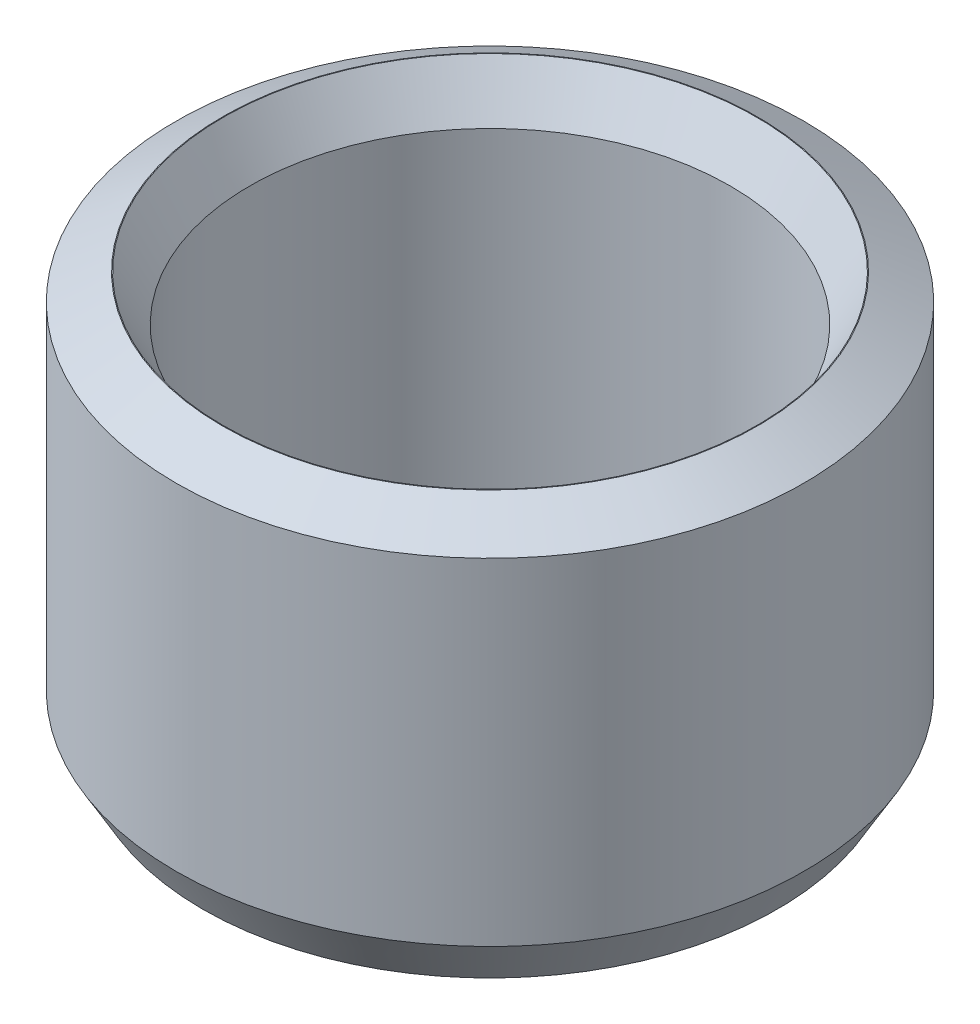
ISO-10303-21;
HEADER;
FILE_DESCRIPTION(('STEP AP214'),'2;1');
FILE_NAME('part.step','',(''),(''),'','','');
FILE_SCHEMA(('AUTOMOTIVE_DESIGN { 1 0 10303 214 1 1 1 1 }'));
ENDSEC;
DATA;
#1=APPLICATION_CONTEXT('core data for automotive mechanical design processes');
#2=APPLICATION_PROTOCOL_DEFINITION('international standard','automotive_design',2000,#1);
#3=PRODUCT_CONTEXT('',#1,'mechanical');
#4=PRODUCT('Part','Part','',(#3));
#5=PRODUCT_RELATED_PRODUCT_CATEGORY('part','',(#4));
#6=PRODUCT_DEFINITION_FORMATION('','',#4);
#7=PRODUCT_DEFINITION_CONTEXT('part definition',#1,'design');
#8=PRODUCT_DEFINITION('design','',#6,#7);
#9=PRODUCT_DEFINITION_SHAPE('','',#8);
#10=(LENGTH_UNIT() NAMED_UNIT(*) SI_UNIT(.MILLI.,.METRE.));
#11=(NAMED_UNIT(*) PLANE_ANGLE_UNIT() SI_UNIT($,.RADIAN.));
#12=(NAMED_UNIT(*) SI_UNIT($,.STERADIAN.) SOLID_ANGLE_UNIT());
#13=UNCERTAINTY_MEASURE_WITH_UNIT(LENGTH_MEASURE(1.E-05),#10,'distance_accuracy_value','');
#14=(GEOMETRIC_REPRESENTATION_CONTEXT(3) GLOBAL_UNCERTAINTY_ASSIGNED_CONTEXT((#13)) GLOBAL_UNIT_ASSIGNED_CONTEXT((#10,
#11,#12)) REPRESENTATION_CONTEXT('',''));
#15=CARTESIAN_POINT('',(0.,0.,0.));
#16=DIRECTION('',(0.,0.,1.));
#17=DIRECTION('',(1.,0.,0.));
#18=AXIS2_PLACEMENT_3D('',#15,#16,#17);
#19=CARTESIAN_POINT('',(0.,45.6149665048605,0.));
#20=DIRECTION('',(0.,-1.,0.));
#21=DIRECTION('',(0.,0.,-1.));
#22=AXIS2_PLACEMENT_3D('',#19,#20,#21);
#23=CYLINDRICAL_SURFACE('',#22,35.);
#24=CARTESIAN_POINT('',(0.,5.14218575600693,0.));
#25=DIRECTION('',(0.,1.,0.));
#26=DIRECTION('',(0.,0.,1.));
#27=AXIS2_PLACEMENT_3D('',#24,#25,#26);
#28=CIRCLE('',#27,35.);
#29=CARTESIAN_POINT('',(0.,5.14218575600693,35.));
#30=VERTEX_POINT('',#29);
#31=EDGE_CURVE('E10',#30,#30,#28,.T.);
#32=ORIENTED_EDGE('',*,*,#31,.T.);
#33=EDGE_LOOP('',(#32));
#34=FACE_BOUND('',#33,.T.);
#35=CARTESIAN_POINT('',(0.,42.6461241744067,0.));
#36=DIRECTION('',(0.,1.,0.));
#37=DIRECTION('',(0.,0.,1.));
#38=AXIS2_PLACEMENT_3D('',#35,#36,#37);
#39=CIRCLE('',#38,35.);
#40=CARTESIAN_POINT('',(0.,42.6461241744067,35.));
#41=VERTEX_POINT('',#40);
#42=EDGE_CURVE('E50',#41,#41,#39,.F.);
#43=ORIENTED_EDGE('',*,*,#42,.T.);
#44=EDGE_LOOP('',(#43));
#45=FACE_BOUND('',#44,.T.);
#46=ADVANCED_FACE('F39',(#34,#45),#23,.T.);
#47=CARTESIAN_POINT('',(0.,45.6149665048605,0.));
#48=DIRECTION('',(0.,1.,0.));
#49=DIRECTION('',(0.,0.,1.));
#50=AXIS2_PLACEMENT_3D('',#47,#48,#49);
#51=PLANE('',#50);
#52=CARTESIAN_POINT('',(0.,45.6149665048605,0.));
#53=DIRECTION('',(0.,1.,0.));
#54=DIRECTION('',(0.,0.,1.));
#55=AXIS2_PLACEMENT_3D('',#52,#53,#54);
#56=CIRCLE('',#55,29.7737043584183);
#57=CARTESIAN_POINT('',(0.,45.6149665048605,29.7737043584183));
#58=VERTEX_POINT('',#57);
#59=EDGE_CURVE('E58',#58,#58,#56,.F.);
#60=ORIENTED_EDGE('',*,*,#59,.T.);
#61=EDGE_LOOP('',(#60));
#62=FACE_BOUND('',#61,.T.);
#63=CARTESIAN_POINT('',(0.,45.6149665048605,0.));
#64=DIRECTION('',(0.,1.,0.));
#65=DIRECTION('',(0.,0.,1.));
#66=AXIS2_PLACEMENT_3D('',#63,#64,#65);
#67=CIRCLE('',#66,29.857814243993);
#68=CARTESIAN_POINT('',(0.,45.6149665048605,29.857814243993));
#69=VERTEX_POINT('',#68);
#70=EDGE_CURVE('E61',#69,#69,#67,.T.);
#71=ORIENTED_EDGE('',*,*,#70,.T.);
#72=EDGE_LOOP('',(#71));
#73=FACE_BOUND('',#72,.T.);
#74=ADVANCED_FACE('F88',(#62,#73),#51,.T.);
#75=CARTESIAN_POINT('',(0.,0.,0.));
#76=DIRECTION('',(0.,1.,0.));
#77=DIRECTION('',(0.,0.,1.));
#78=AXIS2_PLACEMENT_3D('',#75,#76,#77);
#79=PLANE('',#78);
#80=CARTESIAN_POINT('',(0.,0.,0.));
#81=DIRECTION('',(0.,1.,0.));
#82=DIRECTION('',(0.,0.,1.));
#83=AXIS2_PLACEMENT_3D('',#80,#81,#82);
#84=CIRCLE('',#83,31.9470477839715);
#85=CARTESIAN_POINT('',(0.,0.,31.9470477839715));
#86=VERTEX_POINT('',#85);
#87=EDGE_CURVE('E51',#86,#86,#84,.T.);
#88=ORIENTED_EDGE('',*,*,#87,.T.);
#89=EDGE_LOOP('',(#88));
#90=FACE_BOUND('',#89,.T.);
#91=CARTESIAN_POINT('',(0.,0.,0.));
#92=DIRECTION('',(0.,1.,0.));
#93=DIRECTION('',(0.,0.,1.));
#94=AXIS2_PLACEMENT_3D('',#91,#92,#93);
#95=CIRCLE('',#94,32.0311576695463);
#96=CARTESIAN_POINT('',(0.,0.,32.0311576695463));
#97=VERTEX_POINT('',#96);
#98=EDGE_CURVE('E54',#97,#97,#95,.F.);
#99=ORIENTED_EDGE('',*,*,#98,.T.);
#100=EDGE_LOOP('',(#99));
#101=FACE_BOUND('',#100,.T.);
#102=ADVANCED_FACE('F83',(#90,#101),#79,.F.);
#103=CARTESIAN_POINT('',(0.,45.6149665048605,0.));
#104=DIRECTION('',(0.,-1.,0.));
#105=DIRECTION('',(0.,0.,-1.));
#106=AXIS2_PLACEMENT_3D('',#103,#104,#105);
#107=CYLINDRICAL_SURFACE('',#106,26.8048620279645);
#108=CARTESIAN_POINT('',(0.,40.4727807488534,0.));
#109=DIRECTION('',(0.,1.,0.));
#110=DIRECTION('',(0.,0.,1.));
#111=AXIS2_PLACEMENT_3D('',#108,#109,#110);
#112=CIRCLE('',#111,26.8048620279645);
#113=CARTESIAN_POINT('',(0.,40.4727807488534,26.8048620279645));
#114=VERTEX_POINT('',#113);
#115=EDGE_CURVE('E67',#114,#114,#112,.T.);
#116=ORIENTED_EDGE('',*,*,#115,.T.);
#117=EDGE_LOOP('',(#116));
#118=FACE_BOUND('',#117,.T.);
#119=CARTESIAN_POINT('',(0.,2.96884233045371,0.));
#120=DIRECTION('',(0.,1.,0.));
#121=DIRECTION('',(0.,0.,1.));
#122=AXIS2_PLACEMENT_3D('',#119,#120,#121);
#123=CIRCLE('',#122,26.8048620279645);
#124=CARTESIAN_POINT('',(0.,2.96884233045371,26.8048620279645));
#125=VERTEX_POINT('',#124);
#126=EDGE_CURVE('E69',#125,#125,#123,.F.);
#127=ORIENTED_EDGE('',*,*,#126,.T.);
#128=EDGE_LOOP('',(#127));
#129=FACE_BOUND('',#128,.T.);
#130=ADVANCED_FACE('F71',(#118,#129),#107,.F.);
#131=CARTESIAN_POINT('',(0.,40.4727807488534,0.));
#132=DIRECTION('',(0.,1.,0.));
#133=DIRECTION('',(0.,0.,1.));
#134=AXIS2_PLACEMENT_3D('',#131,#132,#133);
#135=CONICAL_SURFACE('',#134,26.8048620279645,0.523598775598301);
#136=ORIENTED_EDGE('',*,*,#59,.F.);
#137=EDGE_LOOP('',(#136));
#138=FACE_BOUND('',#137,.T.);
#139=ORIENTED_EDGE('',*,*,#115,.F.);
#140=EDGE_LOOP('',(#139));
#141=FACE_BOUND('',#140,.T.);
#142=ADVANCED_FACE('F77',(#138,#141),#135,.F.);
#143=CARTESIAN_POINT('',(0.,0.,0.));
#144=DIRECTION('',(0.,-1.,0.));
#145=DIRECTION('',(0.,0.,-1.));
#146=AXIS2_PLACEMENT_3D('',#143,#144,#145);
#147=CONICAL_SURFACE('',#146,31.9470477839715,1.04719755119659);
#148=ORIENTED_EDGE('',*,*,#126,.F.);
#149=EDGE_LOOP('',(#148));
#150=FACE_BOUND('',#149,.T.);
#151=ORIENTED_EDGE('',*,*,#87,.F.);
#152=EDGE_LOOP('',(#151));
#153=FACE_BOUND('',#152,.T.);
#154=ADVANCED_FACE('F73',(#150,#153),#147,.F.);
#155=CARTESIAN_POINT('',(0.,5.14218575600693,0.));
#156=DIRECTION('',(0.,1.,0.));
#157=DIRECTION('',(0.,0.,1.));
#158=AXIS2_PLACEMENT_3D('',#155,#156,#157);
#159=CONICAL_SURFACE('',#158,35.,0.523598775598301);
#160=ORIENTED_EDGE('',*,*,#98,.F.);
#161=EDGE_LOOP('',(#160));
#162=FACE_BOUND('',#161,.T.);
#163=ORIENTED_EDGE('',*,*,#31,.F.);
#164=EDGE_LOOP('',(#163));
#165=FACE_BOUND('',#164,.T.);
#166=ADVANCED_FACE('F76',(#162,#165),#159,.T.);
#167=CARTESIAN_POINT('',(0.,45.6149665048605,0.));
#168=DIRECTION('',(0.,-1.,0.));
#169=DIRECTION('',(0.,0.,-1.));
#170=AXIS2_PLACEMENT_3D('',#167,#168,#169);
#171=CONICAL_SURFACE('',#170,29.857814243993,1.0471975511966);
#172=ORIENTED_EDGE('',*,*,#42,.F.);
#173=EDGE_LOOP('',(#172));
#174=FACE_BOUND('',#173,.T.);
#175=ORIENTED_EDGE('',*,*,#70,.F.);
#176=EDGE_LOOP('',(#175));
#177=FACE_BOUND('',#176,.T.);
#178=ADVANCED_FACE('F45',(#174,#177),#171,.T.);
#179=CLOSED_SHELL('',(#46,#74,#102,#130,#142,#154,#166,#178));
#180=MANIFOLD_SOLID_BREP('B2',#179);
#181=ADVANCED_BREP_SHAPE_REPRESENTATION('',(#18,#180),#14);
#182=SHAPE_DEFINITION_REPRESENTATION(#9,#181);
ENDSEC;
END-ISO-10303-21;
